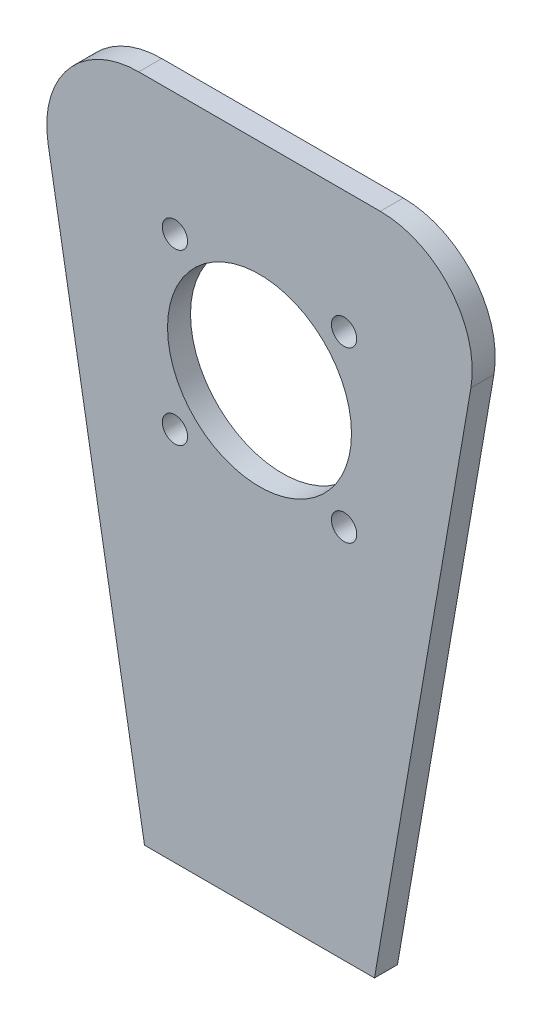
ISO-10303-21;
HEADER;
FILE_DESCRIPTION(('STEP AP214'),'2;1');
FILE_NAME('part.step','',(''),(''),'','','');
FILE_SCHEMA(('AUTOMOTIVE_DESIGN { 1 0 10303 214 1 1 1 1 }'));
ENDSEC;
DATA;
#1=APPLICATION_CONTEXT('core data for automotive mechanical design processes');
#2=APPLICATION_PROTOCOL_DEFINITION('international standard','automotive_design',2000,#1);
#3=PRODUCT_CONTEXT('',#1,'mechanical');
#4=PRODUCT('Part','Part','',(#3));
#5=PRODUCT_RELATED_PRODUCT_CATEGORY('part','',(#4));
#6=PRODUCT_DEFINITION_FORMATION('','',#4);
#7=PRODUCT_DEFINITION_CONTEXT('part definition',#1,'design');
#8=PRODUCT_DEFINITION('design','',#6,#7);
#9=PRODUCT_DEFINITION_SHAPE('','',#8);
#10=(LENGTH_UNIT() NAMED_UNIT(*) SI_UNIT(.MILLI.,.METRE.));
#11=(NAMED_UNIT(*) PLANE_ANGLE_UNIT() SI_UNIT($,.RADIAN.));
#12=(NAMED_UNIT(*) SI_UNIT($,.STERADIAN.) SOLID_ANGLE_UNIT());
#13=UNCERTAINTY_MEASURE_WITH_UNIT(LENGTH_MEASURE(1.E-05),#10,'distance_accuracy_value','');
#14=(GEOMETRIC_REPRESENTATION_CONTEXT(3) GLOBAL_UNCERTAINTY_ASSIGNED_CONTEXT((#13)) GLOBAL_UNIT_ASSIGNED_CONTEXT((#10,
#11,#12)) REPRESENTATION_CONTEXT('',''));
#15=CARTESIAN_POINT('',(0.,0.,0.));
#16=DIRECTION('',(0.,0.,1.));
#17=DIRECTION('',(1.,0.,0.));
#18=AXIS2_PLACEMENT_3D('',#15,#16,#17);
#19=CARTESIAN_POINT('',(0.,0.,5.));
#20=DIRECTION('',(0.,0.,-1.));
#21=DIRECTION('',(-1.,0.,0.));
#22=AXIS2_PLACEMENT_3D('',#19,#20,#21);
#23=PLANE('',#22);
#24=DIRECTION('',(0.169906916507646,0.985460115744348,0.));
#25=VECTOR('',#24,1.);
#26=CARTESIAN_POINT('',(25.,0.,5.));
#27=LINE('',#26,#25);
#28=CARTESIAN_POINT('',(25.,0.,5.));
#29=VERTEX_POINT('',#28);
#30=CARTESIAN_POINT('',(45.9658382189392,121.601861669847,5.));
#31=VERTEX_POINT('',#30);
#32=EDGE_CURVE('E113',#29,#31,#27,.T.);
#33=ORIENTED_EDGE('',*,*,#32,.T.);
#34=CARTESIAN_POINT('',(26.2566359040522,125.,5.));
#35=DIRECTION('',(0.,0.,-1.));
#36=DIRECTION('',(-1.,0.,0.));
#37=AXIS2_PLACEMENT_3D('',#34,#35,#36);
#38=CIRCLE('',#37,20.);
#39=CARTESIAN_POINT('',(26.2566359040522,145.,5.));
#40=VERTEX_POINT('',#39);
#41=EDGE_CURVE('E50',#31,#40,#38,.F.);
#42=ORIENTED_EDGE('',*,*,#41,.T.);
#43=DIRECTION('',(-1.,0.,0.));
#44=VECTOR('',#43,1.);
#45=CARTESIAN_POINT('',(-50.,145.,5.));
#46=LINE('',#45,#44);
#47=CARTESIAN_POINT('',(-26.2566359040522,145.,5.));
#48=VERTEX_POINT('',#47);
#49=EDGE_CURVE('E127',#40,#48,#46,.T.);
#50=ORIENTED_EDGE('',*,*,#49,.T.);
#51=CARTESIAN_POINT('',(-26.2566359040522,125.,5.));
#52=DIRECTION('',(0.,0.,-1.));
#53=DIRECTION('',(-1.,0.,0.));
#54=AXIS2_PLACEMENT_3D('',#51,#52,#53);
#55=CIRCLE('',#54,20.);
#56=CARTESIAN_POINT('',(-45.9658382189392,121.601861669847,5.));
#57=VERTEX_POINT('',#56);
#58=EDGE_CURVE('E57',#48,#57,#55,.F.);
#59=ORIENTED_EDGE('',*,*,#58,.T.);
#60=DIRECTION('',(0.169906916507646,-0.985460115744348,0.));
#61=VECTOR('',#60,1.);
#62=CARTESIAN_POINT('',(-25.,0.,5.));
#63=LINE('',#62,#61);
#64=CARTESIAN_POINT('',(-25.,0.,5.));
#65=VERTEX_POINT('',#64);
#66=EDGE_CURVE('E95',#57,#65,#63,.T.);
#67=ORIENTED_EDGE('',*,*,#66,.T.);
#68=DIRECTION('',(1.,0.,0.));
#69=VECTOR('',#68,1.);
#70=CARTESIAN_POINT('',(25.,0.,5.));
#71=LINE('',#70,#69);
#72=EDGE_CURVE('E98',#65,#29,#71,.T.);
#73=ORIENTED_EDGE('',*,*,#72,.T.);
#74=EDGE_LOOP('',(#33,#42,#50,#59,#67,#73));
#75=FACE_BOUND('',#74,.T.);
#76=CARTESIAN_POINT('',(0.,100.,5.));
#77=DIRECTION('',(0.,0.,1.));
#78=DIRECTION('',(1.,0.,0.));
#79=AXIS2_PLACEMENT_3D('',#76,#77,#78);
#80=CIRCLE('',#79,20.);
#81=CARTESIAN_POINT('',(20.,100.,5.));
#82=VERTEX_POINT('',#81);
#83=EDGE_CURVE('E172',#82,#82,#80,.T.);
#84=ORIENTED_EDGE('',*,*,#83,.F.);
#85=EDGE_LOOP('',(#84));
#86=FACE_BOUND('',#85,.T.);
#87=CARTESIAN_POINT('',(-18.3847763108502,118.38477631085,5.));
#88=DIRECTION('',(0.,0.,1.));
#89=DIRECTION('',(1.,0.,0.));
#90=AXIS2_PLACEMENT_3D('',#87,#88,#89);
#91=CIRCLE('',#90,2.74999999999999);
#92=CARTESIAN_POINT('',(-15.6347763108502,118.38477631085,5.));
#93=VERTEX_POINT('',#92);
#94=EDGE_CURVE('E180',#93,#93,#91,.T.);
#95=ORIENTED_EDGE('',*,*,#94,.F.);
#96=EDGE_LOOP('',(#95));
#97=FACE_BOUND('',#96,.T.);
#98=CARTESIAN_POINT('',(-18.3847763108502,81.6152236891497,5.));
#99=DIRECTION('',(0.,0.,1.));
#100=DIRECTION('',(-1.,0.,0.));
#101=AXIS2_PLACEMENT_3D('',#98,#99,#100);
#102=CIRCLE('',#101,2.74999999999998);
#103=CARTESIAN_POINT('',(-21.1347763108502,81.6152236891497,5.));
#104=VERTEX_POINT('',#103);
#105=EDGE_CURVE('E188',#104,#104,#102,.T.);
#106=ORIENTED_EDGE('',*,*,#105,.F.);
#107=EDGE_LOOP('',(#106));
#108=FACE_BOUND('',#107,.T.);
#109=CARTESIAN_POINT('',(18.3847763108502,81.6152236891497,5.));
#110=DIRECTION('',(0.,0.,1.));
#111=DIRECTION('',(1.,0.,0.));
#112=AXIS2_PLACEMENT_3D('',#109,#110,#111);
#113=CIRCLE('',#112,2.74999999999998);
#114=CARTESIAN_POINT('',(21.1347763108502,81.6152236891497,5.));
#115=VERTEX_POINT('',#114);
#116=EDGE_CURVE('E196',#115,#115,#113,.T.);
#117=ORIENTED_EDGE('',*,*,#116,.F.);
#118=EDGE_LOOP('',(#117));
#119=FACE_BOUND('',#118,.T.);
#120=CARTESIAN_POINT('',(18.3847763108502,118.38477631085,5.));
#121=DIRECTION('',(0.,0.,1.));
#122=DIRECTION('',(-1.,0.,0.));
#123=AXIS2_PLACEMENT_3D('',#120,#121,#122);
#124=CIRCLE('',#123,2.74999999999998);
#125=CARTESIAN_POINT('',(15.6347763108502,118.38477631085,5.));
#126=VERTEX_POINT('',#125);
#127=EDGE_CURVE('E204',#126,#126,#124,.T.);
#128=ORIENTED_EDGE('',*,*,#127,.F.);
#129=EDGE_LOOP('',(#128));
#130=FACE_BOUND('',#129,.T.);
#131=ADVANCED_FACE('F41',(#75,#86,#97,#108,#119,#130),#23,.F.);
#132=CARTESIAN_POINT('',(0.,0.,0.));
#133=DIRECTION('',(0.,0.,-1.));
#134=DIRECTION('',(-1.,0.,0.));
#135=AXIS2_PLACEMENT_3D('',#132,#133,#134);
#136=PLANE('',#135);
#137=CARTESIAN_POINT('',(18.3847763108502,81.6152236891497,0.));
#138=DIRECTION('',(0.,0.,1.));
#139=DIRECTION('',(1.,0.,0.));
#140=AXIS2_PLACEMENT_3D('',#137,#138,#139);
#141=CIRCLE('',#140,2.74999999999998);
#142=CARTESIAN_POINT('',(21.1347763108502,81.6152236891497,0.));
#143=VERTEX_POINT('',#142);
#144=EDGE_CURVE('E200',#143,#143,#141,.T.);
#145=ORIENTED_EDGE('',*,*,#144,.T.);
#146=EDGE_LOOP('',(#145));
#147=FACE_BOUND('',#146,.T.);
#148=CARTESIAN_POINT('',(-18.3847763108502,118.38477631085,0.));
#149=DIRECTION('',(0.,0.,1.));
#150=DIRECTION('',(1.,0.,0.));
#151=AXIS2_PLACEMENT_3D('',#148,#149,#150);
#152=CIRCLE('',#151,2.74999999999999);
#153=CARTESIAN_POINT('',(-15.6347763108502,118.38477631085,0.));
#154=VERTEX_POINT('',#153);
#155=EDGE_CURVE('E184',#154,#154,#152,.T.);
#156=ORIENTED_EDGE('',*,*,#155,.T.);
#157=EDGE_LOOP('',(#156));
#158=FACE_BOUND('',#157,.T.);
#159=DIRECTION('',(-1.,0.,0.));
#160=VECTOR('',#159,1.);
#161=CARTESIAN_POINT('',(-50.,145.,0.));
#162=LINE('',#161,#160);
#163=CARTESIAN_POINT('',(26.2566359040522,145.,0.));
#164=VERTEX_POINT('',#163);
#165=CARTESIAN_POINT('',(-26.2566359040522,145.,0.));
#166=VERTEX_POINT('',#165);
#167=EDGE_CURVE('E104',#164,#166,#162,.T.);
#168=ORIENTED_EDGE('',*,*,#167,.F.);
#169=CARTESIAN_POINT('',(26.2566359040522,125.,0.));
#170=DIRECTION('',(0.,0.,-1.));
#171=DIRECTION('',(-1.,0.,0.));
#172=AXIS2_PLACEMENT_3D('',#169,#170,#171);
#173=CIRCLE('',#172,20.);
#174=CARTESIAN_POINT('',(45.9658382189392,121.601861669847,0.));
#175=VERTEX_POINT('',#174);
#176=EDGE_CURVE('E137',#164,#175,#173,.T.);
#177=ORIENTED_EDGE('',*,*,#176,.T.);
#178=DIRECTION('',(0.169906916507646,0.985460115744348,0.));
#179=VECTOR('',#178,1.);
#180=CARTESIAN_POINT('',(25.,0.,0.));
#181=LINE('',#180,#179);
#182=CARTESIAN_POINT('',(25.,0.,0.));
#183=VERTEX_POINT('',#182);
#184=EDGE_CURVE('E161',#183,#175,#181,.T.);
#185=ORIENTED_EDGE('',*,*,#184,.F.);
#186=DIRECTION('',(1.,0.,0.));
#187=VECTOR('',#186,1.);
#188=CARTESIAN_POINT('',(25.,0.,0.));
#189=LINE('',#188,#187);
#190=CARTESIAN_POINT('',(-25.,0.,0.));
#191=VERTEX_POINT('',#190);
#192=EDGE_CURVE('E164',#191,#183,#189,.T.);
#193=ORIENTED_EDGE('',*,*,#192,.F.);
#194=DIRECTION('',(0.169906916507646,-0.985460115744348,0.));
#195=VECTOR('',#194,1.);
#196=CARTESIAN_POINT('',(-25.,0.,0.));
#197=LINE('',#196,#195);
#198=CARTESIAN_POINT('',(-45.9658382189392,121.601861669847,0.));
#199=VERTEX_POINT('',#198);
#200=EDGE_CURVE('E117',#199,#191,#197,.T.);
#201=ORIENTED_EDGE('',*,*,#200,.F.);
#202=CARTESIAN_POINT('',(-26.2566359040522,125.,0.));
#203=DIRECTION('',(0.,0.,-1.));
#204=DIRECTION('',(-1.,0.,0.));
#205=AXIS2_PLACEMENT_3D('',#202,#203,#204);
#206=CIRCLE('',#205,20.);
#207=EDGE_CURVE('E134',#199,#166,#206,.T.);
#208=ORIENTED_EDGE('',*,*,#207,.T.);
#209=EDGE_LOOP('',(#168,#177,#185,#193,#201,#208));
#210=FACE_BOUND('',#209,.T.);
#211=CARTESIAN_POINT('',(0.,100.,0.));
#212=DIRECTION('',(0.,0.,1.));
#213=DIRECTION('',(1.,0.,0.));
#214=AXIS2_PLACEMENT_3D('',#211,#212,#213);
#215=CIRCLE('',#214,20.);
#216=CARTESIAN_POINT('',(20.,100.,0.));
#217=VERTEX_POINT('',#216);
#218=EDGE_CURVE('E176',#217,#217,#215,.T.);
#219=ORIENTED_EDGE('',*,*,#218,.T.);
#220=EDGE_LOOP('',(#219));
#221=FACE_BOUND('',#220,.T.);
#222=CARTESIAN_POINT('',(-18.3847763108502,81.6152236891497,0.));
#223=DIRECTION('',(0.,0.,1.));
#224=DIRECTION('',(-1.,0.,0.));
#225=AXIS2_PLACEMENT_3D('',#222,#223,#224);
#226=CIRCLE('',#225,2.74999999999998);
#227=CARTESIAN_POINT('',(-21.1347763108502,81.6152236891497,0.));
#228=VERTEX_POINT('',#227);
#229=EDGE_CURVE('E192',#228,#228,#226,.T.);
#230=ORIENTED_EDGE('',*,*,#229,.T.);
#231=EDGE_LOOP('',(#230));
#232=FACE_BOUND('',#231,.T.);
#233=CARTESIAN_POINT('',(18.3847763108502,118.38477631085,0.));
#234=DIRECTION('',(0.,0.,1.));
#235=DIRECTION('',(-1.,0.,0.));
#236=AXIS2_PLACEMENT_3D('',#233,#234,#235);
#237=CIRCLE('',#236,2.74999999999998);
#238=CARTESIAN_POINT('',(15.6347763108502,118.38477631085,0.));
#239=VERTEX_POINT('',#238);
#240=EDGE_CURVE('E208',#239,#239,#237,.T.);
#241=ORIENTED_EDGE('',*,*,#240,.T.);
#242=EDGE_LOOP('',(#241));
#243=FACE_BOUND('',#242,.T.);
#244=ADVANCED_FACE('F159',(#147,#158,#210,#221,#232,#243),#136,.T.);
#245=CARTESIAN_POINT('',(-25.,0.,5.));
#246=DIRECTION('',(0.985460115744348,0.169906916507646,0.));
#247=DIRECTION('',(-0.169906916507646,0.985460115744348,0.));
#248=AXIS2_PLACEMENT_3D('',#245,#246,#247);
#249=PLANE('',#248);
#250=ORIENTED_EDGE('',*,*,#66,.F.);
#251=DIRECTION('',(0.,0.,-1.));
#252=VECTOR('',#251,1.);
#253=CARTESIAN_POINT('',(-45.9658382189392,121.601861669847,5.));
#254=LINE('',#253,#252);
#255=EDGE_CURVE('E11',#57,#199,#254,.T.);
#256=ORIENTED_EDGE('',*,*,#255,.T.);
#257=ORIENTED_EDGE('',*,*,#200,.T.);
#258=DIRECTION('',(0.,0.,-1.));
#259=VECTOR('',#258,1.);
#260=CARTESIAN_POINT('',(-25.,0.,5.));
#261=LINE('',#260,#259);
#262=EDGE_CURVE('E109',#65,#191,#261,.T.);
#263=ORIENTED_EDGE('',*,*,#262,.F.);
#264=EDGE_LOOP('',(#250,#256,#257,#263));
#265=FACE_BOUND('',#264,.T.);
#266=ADVANCED_FACE('F115',(#265),#249,.F.);
#267=CARTESIAN_POINT('',(25.,0.,5.));
#268=DIRECTION('',(0.,1.,0.));
#269=DIRECTION('',(0.,0.,1.));
#270=AXIS2_PLACEMENT_3D('',#267,#268,#269);
#271=PLANE('',#270);
#272=ORIENTED_EDGE('',*,*,#192,.T.);
#273=DIRECTION('',(0.,0.,-1.));
#274=VECTOR('',#273,1.);
#275=CARTESIAN_POINT('',(25.,0.,5.));
#276=LINE('',#275,#274);
#277=EDGE_CURVE('E111',#29,#183,#276,.T.);
#278=ORIENTED_EDGE('',*,*,#277,.F.);
#279=ORIENTED_EDGE('',*,*,#72,.F.);
#280=ORIENTED_EDGE('',*,*,#262,.T.);
#281=EDGE_LOOP('',(#272,#278,#279,#280));
#282=FACE_BOUND('',#281,.T.);
#283=ADVANCED_FACE('F108',(#282),#271,.F.);
#284=CARTESIAN_POINT('',(25.,0.,5.));
#285=DIRECTION('',(-0.985460115744348,0.169906916507646,0.));
#286=DIRECTION('',(-0.169906916507646,-0.985460115744348,0.));
#287=AXIS2_PLACEMENT_3D('',#284,#285,#286);
#288=PLANE('',#287);
#289=ORIENTED_EDGE('',*,*,#184,.T.);
#290=DIRECTION('',(0.,0.,-1.));
#291=VECTOR('',#290,1.);
#292=CARTESIAN_POINT('',(45.9658382189392,121.601861669847,5.));
#293=LINE('',#292,#291);
#294=EDGE_CURVE('E65',#175,#31,#293,.F.);
#295=ORIENTED_EDGE('',*,*,#294,.T.);
#296=ORIENTED_EDGE('',*,*,#32,.F.);
#297=ORIENTED_EDGE('',*,*,#277,.T.);
#298=EDGE_LOOP('',(#289,#295,#296,#297));
#299=FACE_BOUND('',#298,.T.);
#300=ADVANCED_FACE('F162',(#299),#288,.F.);
#301=CARTESIAN_POINT('',(-50.,145.,5.));
#302=DIRECTION('',(0.,-1.,0.));
#303=DIRECTION('',(0.,0.,-1.));
#304=AXIS2_PLACEMENT_3D('',#301,#302,#303);
#305=PLANE('',#304);
#306=ORIENTED_EDGE('',*,*,#49,.F.);
#307=DIRECTION('',(0.,0.,-1.));
#308=VECTOR('',#307,1.);
#309=CARTESIAN_POINT('',(26.2566359040522,145.,5.));
#310=LINE('',#309,#308);
#311=EDGE_CURVE('E125',#40,#164,#310,.T.);
#312=ORIENTED_EDGE('',*,*,#311,.T.);
#313=ORIENTED_EDGE('',*,*,#167,.T.);
#314=DIRECTION('',(0.,0.,-1.));
#315=VECTOR('',#314,1.);
#316=CARTESIAN_POINT('',(-26.2566359040522,145.,5.));
#317=LINE('',#316,#315);
#318=EDGE_CURVE('E120',#166,#48,#317,.F.);
#319=ORIENTED_EDGE('',*,*,#318,.T.);
#320=EDGE_LOOP('',(#306,#312,#313,#319));
#321=FACE_BOUND('',#320,.T.);
#322=ADVANCED_FACE('F150',(#321),#305,.F.);
#323=CARTESIAN_POINT('',(0.,100.,5.));
#324=DIRECTION('',(0.,0.,-1.));
#325=DIRECTION('',(-1.,0.,0.));
#326=AXIS2_PLACEMENT_3D('',#323,#324,#325);
#327=CYLINDRICAL_SURFACE('',#326,20.);
#328=ORIENTED_EDGE('',*,*,#83,.T.);
#329=EDGE_LOOP('',(#328));
#330=FACE_BOUND('',#329,.T.);
#331=ORIENTED_EDGE('',*,*,#218,.F.);
#332=EDGE_LOOP('',(#331));
#333=FACE_BOUND('',#332,.T.);
#334=ADVANCED_FACE('F228',(#330,#333),#327,.F.);
#335=CARTESIAN_POINT('',(-18.3847763108502,118.38477631085,5.));
#336=DIRECTION('',(0.,0.,-1.));
#337=DIRECTION('',(-1.,0.,0.));
#338=AXIS2_PLACEMENT_3D('',#335,#336,#337);
#339=CYLINDRICAL_SURFACE('',#338,2.74999999999999);
#340=ORIENTED_EDGE('',*,*,#94,.T.);
#341=EDGE_LOOP('',(#340));
#342=FACE_BOUND('',#341,.T.);
#343=ORIENTED_EDGE('',*,*,#155,.F.);
#344=EDGE_LOOP('',(#343));
#345=FACE_BOUND('',#344,.T.);
#346=ADVANCED_FACE('F254',(#342,#345),#339,.F.);
#347=CARTESIAN_POINT('',(-18.3847763108502,81.6152236891497,5.));
#348=DIRECTION('',(0.,0.,-1.));
#349=DIRECTION('',(-1.,0.,0.));
#350=AXIS2_PLACEMENT_3D('',#347,#348,#349);
#351=CYLINDRICAL_SURFACE('',#350,2.74999999999998);
#352=ORIENTED_EDGE('',*,*,#105,.T.);
#353=EDGE_LOOP('',(#352));
#354=FACE_BOUND('',#353,.T.);
#355=ORIENTED_EDGE('',*,*,#229,.F.);
#356=EDGE_LOOP('',(#355));
#357=FACE_BOUND('',#356,.T.);
#358=ADVANCED_FACE('F249',(#354,#357),#351,.F.);
#359=CARTESIAN_POINT('',(18.3847763108502,81.6152236891497,5.));
#360=DIRECTION('',(0.,0.,-1.));
#361=DIRECTION('',(-1.,0.,0.));
#362=AXIS2_PLACEMENT_3D('',#359,#360,#361);
#363=CYLINDRICAL_SURFACE('',#362,2.74999999999998);
#364=ORIENTED_EDGE('',*,*,#116,.T.);
#365=EDGE_LOOP('',(#364));
#366=FACE_BOUND('',#365,.T.);
#367=ORIENTED_EDGE('',*,*,#144,.F.);
#368=EDGE_LOOP('',(#367));
#369=FACE_BOUND('',#368,.T.);
#370=ADVANCED_FACE('F244',(#366,#369),#363,.F.);
#371=CARTESIAN_POINT('',(18.3847763108502,118.38477631085,5.));
#372=DIRECTION('',(0.,0.,-1.));
#373=DIRECTION('',(-1.,0.,0.));
#374=AXIS2_PLACEMENT_3D('',#371,#372,#373);
#375=CYLINDRICAL_SURFACE('',#374,2.74999999999998);
#376=ORIENTED_EDGE('',*,*,#127,.T.);
#377=EDGE_LOOP('',(#376));
#378=FACE_BOUND('',#377,.T.);
#379=ORIENTED_EDGE('',*,*,#240,.F.);
#380=EDGE_LOOP('',(#379));
#381=FACE_BOUND('',#380,.T.);
#382=ADVANCED_FACE('F217',(#378,#381),#375,.F.);
#383=CARTESIAN_POINT('',(26.2566359040522,125.,5.));
#384=DIRECTION('',(0.,0.,-1.));
#385=DIRECTION('',(-1.,0.,0.));
#386=AXIS2_PLACEMENT_3D('',#383,#384,#385);
#387=CYLINDRICAL_SURFACE('',#386,20.);
#388=ORIENTED_EDGE('',*,*,#41,.F.);
#389=ORIENTED_EDGE('',*,*,#294,.F.);
#390=ORIENTED_EDGE('',*,*,#176,.F.);
#391=ORIENTED_EDGE('',*,*,#311,.F.);
#392=EDGE_LOOP('',(#388,#389,#390,#391));
#393=FACE_BOUND('',#392,.T.);
#394=ADVANCED_FACE('F156',(#393),#387,.T.);
#395=CARTESIAN_POINT('',(-26.2566359040522,125.,5.));
#396=DIRECTION('',(0.,0.,-1.));
#397=DIRECTION('',(-1.,0.,0.));
#398=AXIS2_PLACEMENT_3D('',#395,#396,#397);
#399=CYLINDRICAL_SURFACE('',#398,20.);
#400=ORIENTED_EDGE('',*,*,#58,.F.);
#401=ORIENTED_EDGE('',*,*,#318,.F.);
#402=ORIENTED_EDGE('',*,*,#207,.F.);
#403=ORIENTED_EDGE('',*,*,#255,.F.);
#404=EDGE_LOOP('',(#400,#401,#402,#403));
#405=FACE_BOUND('',#404,.T.);
#406=ADVANCED_FACE('F43',(#405),#399,.T.);
#407=CLOSED_SHELL('',(#131,#244,#266,#283,#300,#322,#334,#346,#358,#370,#382,#394,#406));
#408=MANIFOLD_SOLID_BREP('B2',#407);
#409=ADVANCED_BREP_SHAPE_REPRESENTATION('',(#18,#408),#14);
#410=SHAPE_DEFINITION_REPRESENTATION(#9,#409);
ENDSEC;
END-ISO-10303-21;
